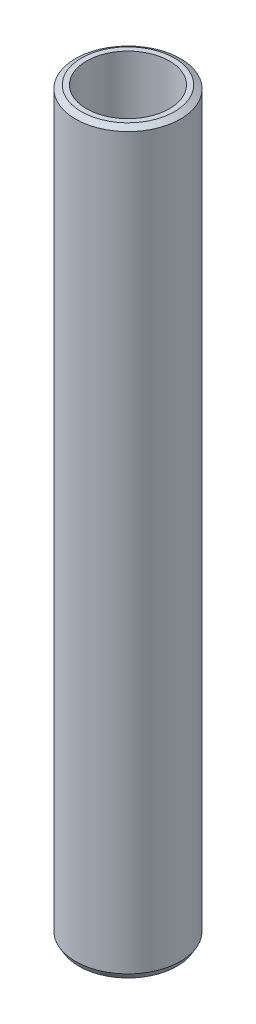
ISO-10303-21;
HEADER;
FILE_DESCRIPTION(('STEP AP214'),'2;1');
FILE_NAME('part.step','',(''),(''),'','','');
FILE_SCHEMA(('AUTOMOTIVE_DESIGN { 1 0 10303 214 1 1 1 1 }'));
ENDSEC;
DATA;
#1=APPLICATION_CONTEXT('core data for automotive mechanical design processes');
#2=APPLICATION_PROTOCOL_DEFINITION('international standard','automotive_design',2000,#1);
#3=PRODUCT_CONTEXT('',#1,'mechanical');
#4=PRODUCT('Part','Part','',(#3));
#5=PRODUCT_RELATED_PRODUCT_CATEGORY('part','',(#4));
#6=PRODUCT_DEFINITION_FORMATION('','',#4);
#7=PRODUCT_DEFINITION_CONTEXT('part definition',#1,'design');
#8=PRODUCT_DEFINITION('design','',#6,#7);
#9=PRODUCT_DEFINITION_SHAPE('','',#8);
#10=(LENGTH_UNIT() NAMED_UNIT(*) SI_UNIT(.MILLI.,.METRE.));
#11=(NAMED_UNIT(*) PLANE_ANGLE_UNIT() SI_UNIT($,.RADIAN.));
#12=(NAMED_UNIT(*) SI_UNIT($,.STERADIAN.) SOLID_ANGLE_UNIT());
#13=UNCERTAINTY_MEASURE_WITH_UNIT(LENGTH_MEASURE(1.E-05),#10,'distance_accuracy_value','');
#14=(GEOMETRIC_REPRESENTATION_CONTEXT(3) GLOBAL_UNCERTAINTY_ASSIGNED_CONTEXT((#13)) GLOBAL_UNIT_ASSIGNED_CONTEXT((#10,
#11,#12)) REPRESENTATION_CONTEXT('',''));
#15=CARTESIAN_POINT('',(0.,0.,0.));
#16=DIRECTION('',(0.,0.,1.));
#17=DIRECTION('',(1.,0.,0.));
#18=AXIS2_PLACEMENT_3D('',#15,#16,#17);
#19=CARTESIAN_POINT('',(0.,493.145552171408,0.));
#20=DIRECTION('',(0.,-1.,0.));
#21=DIRECTION('',(0.,0.,-1.));
#22=AXIS2_PLACEMENT_3D('',#19,#20,#21);
#23=CYLINDRICAL_SURFACE('',#22,35.);
#24=CARTESIAN_POINT('',(0.,490.861837666706,0.));
#25=DIRECTION('',(0.,1.,0.));
#26=DIRECTION('',(0.,0.,1.));
#27=AXIS2_PLACEMENT_3D('',#24,#25,#26);
#28=CIRCLE('',#27,35.);
#29=CARTESIAN_POINT('',(0.,490.861837666706,35.));
#30=VERTEX_POINT('',#29);
#31=EDGE_CURVE('E50',#30,#30,#28,.F.);
#32=ORIENTED_EDGE('',*,*,#31,.T.);
#33=EDGE_LOOP('',(#32));
#34=FACE_BOUND('',#33,.T.);
#35=CARTESIAN_POINT('',(0.,3.95550955212537,0.));
#36=DIRECTION('',(0.,1.,0.));
#37=DIRECTION('',(0.,0.,1.));
#38=AXIS2_PLACEMENT_3D('',#35,#36,#37);
#39=CIRCLE('',#38,35.);
#40=CARTESIAN_POINT('',(0.,3.95550955212537,35.));
#41=VERTEX_POINT('',#40);
#42=EDGE_CURVE('E51',#41,#41,#39,.T.);
#43=ORIENTED_EDGE('',*,*,#42,.T.);
#44=EDGE_LOOP('',(#43));
#45=FACE_BOUND('',#44,.T.);
#46=ADVANCED_FACE('F39',(#34,#45),#23,.T.);
#47=CARTESIAN_POINT('',(0.,493.145552171408,0.));
#48=DIRECTION('',(0.,1.,0.));
#49=DIRECTION('',(0.,0.,1.));
#50=AXIS2_PLACEMENT_3D('',#47,#48,#49);
#51=PLANE('',#50);
#52=CARTESIAN_POINT('',(0.,493.145552171408,0.));
#53=DIRECTION('',(0.,1.,0.));
#54=DIRECTION('',(0.,0.,1.));
#55=AXIS2_PLACEMENT_3D('',#52,#53,#54);
#56=CIRCLE('',#55,31.0444904478744);
#57=CARTESIAN_POINT('',(0.,493.145552171408,31.0444904478744));
#58=VERTEX_POINT('',#57);
#59=EDGE_CURVE('E54',#58,#58,#56,.T.);
#60=ORIENTED_EDGE('',*,*,#59,.T.);
#61=EDGE_LOOP('',(#60));
#62=FACE_BOUND('',#61,.T.);
#63=CARTESIAN_POINT('',(0.,493.145552171408,0.));
#64=DIRECTION('',(0.,1.,0.));
#65=DIRECTION('',(0.,0.,1.));
#66=AXIS2_PLACEMENT_3D('',#63,#64,#65);
#67=CIRCLE('',#66,27.6499218174369);
#68=CARTESIAN_POINT('',(0.,493.145552171408,27.6499218174369));
#69=VERTEX_POINT('',#68);
#70=EDGE_CURVE('E58',#69,#69,#67,.T.);
#71=ORIENTED_EDGE('',*,*,#70,.F.);
#72=EDGE_LOOP('',(#71));
#73=FACE_BOUND('',#72,.T.);
#74=ADVANCED_FACE('F69',(#62,#73),#51,.T.);
#75=CARTESIAN_POINT('',(0.,0.,0.));
#76=DIRECTION('',(0.,1.,0.));
#77=DIRECTION('',(0.,0.,1.));
#78=AXIS2_PLACEMENT_3D('',#75,#76,#77);
#79=PLANE('',#78);
#80=CARTESIAN_POINT('',(0.,0.,0.));
#81=DIRECTION('',(0.,1.,0.));
#82=DIRECTION('',(0.,0.,1.));
#83=AXIS2_PLACEMENT_3D('',#80,#81,#82);
#84=CIRCLE('',#83,32.7162854952983);
#85=CARTESIAN_POINT('',(0.,0.,32.7162854952983));
#86=VERTEX_POINT('',#85);
#87=EDGE_CURVE('E10',#86,#86,#84,.F.);
#88=ORIENTED_EDGE('',*,*,#87,.T.);
#89=EDGE_LOOP('',(#88));
#90=FACE_BOUND('',#89,.T.);
#91=CARTESIAN_POINT('',(0.,0.,0.));
#92=DIRECTION('',(0.,1.,0.));
#93=DIRECTION('',(0.,0.,1.));
#94=AXIS2_PLACEMENT_3D('',#91,#92,#93);
#95=CIRCLE('',#94,27.6499218174369);
#96=CARTESIAN_POINT('',(0.,0.,27.6499218174369));
#97=VERTEX_POINT('',#96);
#98=EDGE_CURVE('E63',#97,#97,#95,.T.);
#99=ORIENTED_EDGE('',*,*,#98,.T.);
#100=EDGE_LOOP('',(#99));
#101=FACE_BOUND('',#100,.T.);
#102=ADVANCED_FACE('F75',(#90,#101),#79,.F.);
#103=CARTESIAN_POINT('',(0.,493.145552171408,0.));
#104=DIRECTION('',(0.,-1.,0.));
#105=DIRECTION('',(0.,0.,-1.));
#106=AXIS2_PLACEMENT_3D('',#103,#104,#105);
#107=CYLINDRICAL_SURFACE('',#106,27.6499218174369);
#108=ORIENTED_EDGE('',*,*,#70,.T.);
#109=EDGE_LOOP('',(#108));
#110=FACE_BOUND('',#109,.T.);
#111=ORIENTED_EDGE('',*,*,#98,.F.);
#112=EDGE_LOOP('',(#111));
#113=FACE_BOUND('',#112,.T.);
#114=ADVANCED_FACE('F70',(#110,#113),#107,.F.);
#115=CARTESIAN_POINT('',(0.,493.145552171408,0.));
#116=DIRECTION('',(0.,-1.,0.));
#117=DIRECTION('',(0.,0.,-1.));
#118=AXIS2_PLACEMENT_3D('',#115,#116,#117);
#119=CONICAL_SURFACE('',#118,31.0444904478744,1.04719755119659);
#120=ORIENTED_EDGE('',*,*,#31,.F.);
#121=EDGE_LOOP('',(#120));
#122=FACE_BOUND('',#121,.T.);
#123=ORIENTED_EDGE('',*,*,#59,.F.);
#124=EDGE_LOOP('',(#123));
#125=FACE_BOUND('',#124,.T.);
#126=ADVANCED_FACE('F81',(#122,#125),#119,.T.);
#127=CARTESIAN_POINT('',(0.,3.95550955212537,0.));
#128=DIRECTION('',(0.,1.,0.));
#129=DIRECTION('',(0.,0.,1.));
#130=AXIS2_PLACEMENT_3D('',#127,#128,#129);
#131=CONICAL_SURFACE('',#130,35.,0.5235987755983);
#132=ORIENTED_EDGE('',*,*,#87,.F.);
#133=EDGE_LOOP('',(#132));
#134=FACE_BOUND('',#133,.T.);
#135=ORIENTED_EDGE('',*,*,#42,.F.);
#136=EDGE_LOOP('',(#135));
#137=FACE_BOUND('',#136,.T.);
#138=ADVANCED_FACE('F45',(#134,#137),#131,.T.);
#139=CLOSED_SHELL('',(#46,#74,#102,#114,#126,#138));
#140=MANIFOLD_SOLID_BREP('B2',#139);
#141=ADVANCED_BREP_SHAPE_REPRESENTATION('',(#18,#140),#14);
#142=SHAPE_DEFINITION_REPRESENTATION(#9,#141);
ENDSEC;
END-ISO-10303-21;
